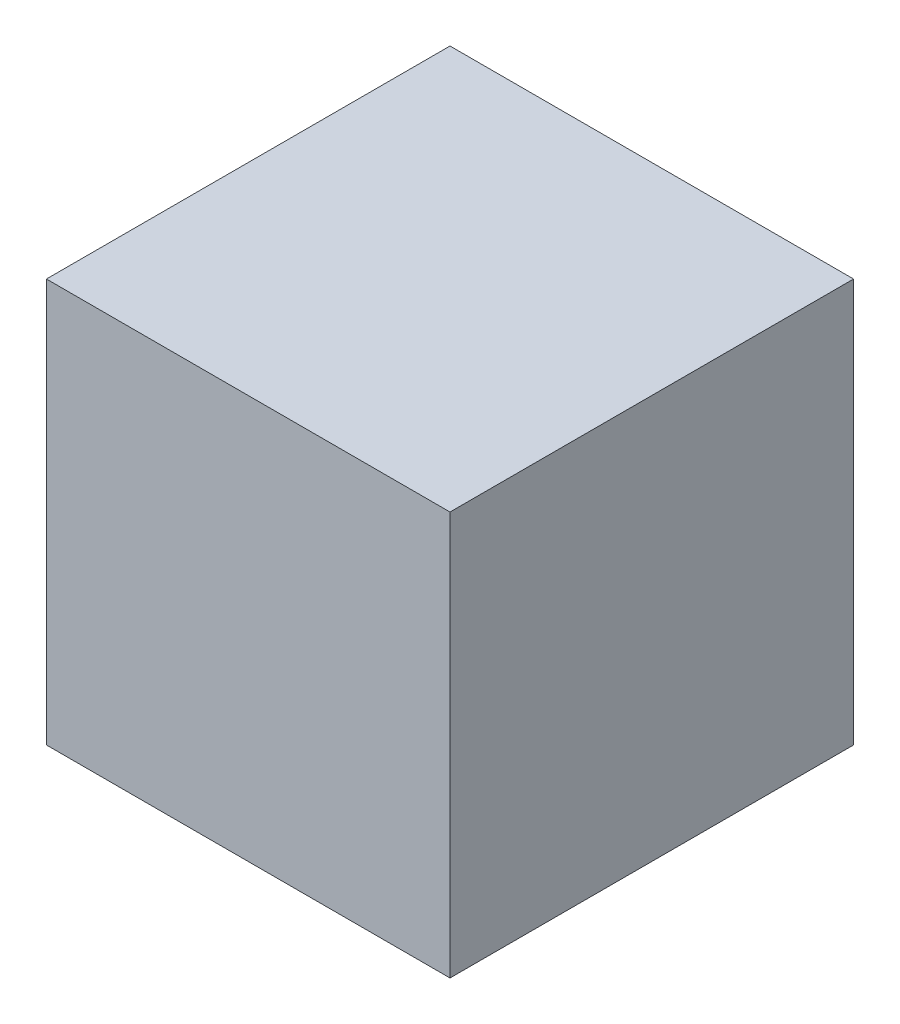
ISO-10303-21;
HEADER;
FILE_DESCRIPTION(('STEP AP214'),'2;1');
FILE_NAME('part.step','',(''),(''),'','','');
FILE_SCHEMA(('AUTOMOTIVE_DESIGN { 1 0 10303 214 1 1 1 1 }'));
ENDSEC;
DATA;
#1=APPLICATION_CONTEXT('core data for automotive mechanical design processes');
#2=APPLICATION_PROTOCOL_DEFINITION('international standard','automotive_design',2000,#1);
#3=PRODUCT_CONTEXT('',#1,'mechanical');
#4=PRODUCT('Part','Part','',(#3));
#5=PRODUCT_RELATED_PRODUCT_CATEGORY('part','',(#4));
#6=PRODUCT_DEFINITION_FORMATION('','',#4);
#7=PRODUCT_DEFINITION_CONTEXT('part definition',#1,'design');
#8=PRODUCT_DEFINITION('design','',#6,#7);
#9=PRODUCT_DEFINITION_SHAPE('','',#8);
#10=(LENGTH_UNIT() NAMED_UNIT(*) SI_UNIT(.MILLI.,.METRE.));
#11=(NAMED_UNIT(*) PLANE_ANGLE_UNIT() SI_UNIT($,.RADIAN.));
#12=(NAMED_UNIT(*) SI_UNIT($,.STERADIAN.) SOLID_ANGLE_UNIT());
#13=UNCERTAINTY_MEASURE_WITH_UNIT(LENGTH_MEASURE(1.E-05),#10,'distance_accuracy_value','');
#14=(GEOMETRIC_REPRESENTATION_CONTEXT(3) GLOBAL_UNCERTAINTY_ASSIGNED_CONTEXT((#13)) GLOBAL_UNIT_ASSIGNED_CONTEXT((#10,
#11,#12)) REPRESENTATION_CONTEXT('',''));
#15=CARTESIAN_POINT('',(0.,0.,0.));
#16=DIRECTION('',(0.,0.,1.));
#17=DIRECTION('',(1.,0.,0.));
#18=AXIS2_PLACEMENT_3D('',#15,#16,#17);
#19=CARTESIAN_POINT('',(304.8,0.,-304.8));
#20=DIRECTION('',(0.,0.,-1.));
#21=DIRECTION('',(0.,1.,0.));
#22=AXIS2_PLACEMENT_3D('',#19,#20,#21);
#23=PLANE('',#22);
#24=DIRECTION('',(0.,-1.,0.));
#25=VECTOR('',#24,1.);
#26=CARTESIAN_POINT('',(-304.8,0.,-304.8));
#27=LINE('',#26,#25);
#28=CARTESIAN_POINT('',(-304.8,609.6,-304.8));
#29=VERTEX_POINT('',#28);
#30=CARTESIAN_POINT('',(-304.8,0.,-304.8));
#31=VERTEX_POINT('',#30);
#32=EDGE_CURVE('E103',#29,#31,#27,.T.);
#33=ORIENTED_EDGE('',*,*,#32,.F.);
#34=DIRECTION('',(-1.,0.,0.));
#35=VECTOR('',#34,1.);
#36=CARTESIAN_POINT('',(304.8,609.6,-304.8));
#37=LINE('',#36,#35);
#38=CARTESIAN_POINT('',(304.8,609.6,-304.8));
#39=VERTEX_POINT('',#38);
#40=EDGE_CURVE('E11',#39,#29,#37,.T.);
#41=ORIENTED_EDGE('',*,*,#40,.F.);
#42=DIRECTION('',(0.,-1.,0.));
#43=VECTOR('',#42,1.);
#44=CARTESIAN_POINT('',(304.8,0.,-304.8));
#45=LINE('',#44,#43);
#46=CARTESIAN_POINT('',(304.8,0.,-304.8));
#47=VERTEX_POINT('',#46);
#48=EDGE_CURVE('E97',#39,#47,#45,.T.);
#49=ORIENTED_EDGE('',*,*,#48,.T.);
#50=DIRECTION('',(-1.,0.,0.));
#51=VECTOR('',#50,1.);
#52=CARTESIAN_POINT('',(304.8,0.,-304.8));
#53=LINE('',#52,#51);
#54=EDGE_CURVE('E78',#47,#31,#53,.T.);
#55=ORIENTED_EDGE('',*,*,#54,.T.);
#56=EDGE_LOOP('',(#33,#41,#49,#55));
#57=FACE_BOUND('',#56,.T.);
#58=ADVANCED_FACE('F40',(#57),#23,.T.);
#59=CARTESIAN_POINT('',(304.8,609.6,0.));
#60=DIRECTION('',(0.,1.,0.));
#61=DIRECTION('',(0.,0.,1.));
#62=AXIS2_PLACEMENT_3D('',#59,#60,#61);
#63=PLANE('',#62);
#64=DIRECTION('',(0.,0.,-1.));
#65=VECTOR('',#64,1.);
#66=CARTESIAN_POINT('',(-304.8,609.6,0.));
#67=LINE('',#66,#65);
#68=CARTESIAN_POINT('',(-304.8,609.6,304.8));
#69=VERTEX_POINT('',#68);
#70=EDGE_CURVE('E91',#69,#29,#67,.T.);
#71=ORIENTED_EDGE('',*,*,#70,.F.);
#72=DIRECTION('',(-1.,0.,0.));
#73=VECTOR('',#72,1.);
#74=CARTESIAN_POINT('',(304.8,609.6,304.8));
#75=LINE('',#74,#73);
#76=CARTESIAN_POINT('',(304.8,609.6,304.8));
#77=VERTEX_POINT('',#76);
#78=EDGE_CURVE('E48',#77,#69,#75,.T.);
#79=ORIENTED_EDGE('',*,*,#78,.F.);
#80=DIRECTION('',(0.,0.,-1.));
#81=VECTOR('',#80,1.);
#82=CARTESIAN_POINT('',(304.8,609.6,0.));
#83=LINE('',#82,#81);
#84=EDGE_CURVE('E89',#77,#39,#83,.T.);
#85=ORIENTED_EDGE('',*,*,#84,.T.);
#86=ORIENTED_EDGE('',*,*,#40,.T.);
#87=EDGE_LOOP('',(#71,#79,#85,#86));
#88=FACE_BOUND('',#87,.T.);
#89=ADVANCED_FACE('F87',(#88),#63,.T.);
#90=CARTESIAN_POINT('',(304.8,0.,304.8));
#91=DIRECTION('',(0.,0.,-1.));
#92=DIRECTION('',(0.,1.,0.));
#93=AXIS2_PLACEMENT_3D('',#90,#91,#92);
#94=PLANE('',#93);
#95=DIRECTION('',(0.,-1.,0.));
#96=VECTOR('',#95,1.);
#97=CARTESIAN_POINT('',(-304.8,0.,304.8));
#98=LINE('',#97,#96);
#99=CARTESIAN_POINT('',(-304.8,0.,304.8));
#100=VERTEX_POINT('',#99);
#101=EDGE_CURVE('E71',#69,#100,#98,.T.);
#102=ORIENTED_EDGE('',*,*,#101,.T.);
#103=DIRECTION('',(-1.,0.,0.));
#104=VECTOR('',#103,1.);
#105=CARTESIAN_POINT('',(304.8,0.,304.8));
#106=LINE('',#105,#104);
#107=CARTESIAN_POINT('',(304.8,0.,304.8));
#108=VERTEX_POINT('',#107);
#109=EDGE_CURVE('E92',#108,#100,#106,.T.);
#110=ORIENTED_EDGE('',*,*,#109,.F.);
#111=DIRECTION('',(0.,-1.,0.));
#112=VECTOR('',#111,1.);
#113=CARTESIAN_POINT('',(304.8,0.,304.8));
#114=LINE('',#113,#112);
#115=EDGE_CURVE('E93',#77,#108,#114,.T.);
#116=ORIENTED_EDGE('',*,*,#115,.F.);
#117=ORIENTED_EDGE('',*,*,#78,.T.);
#118=EDGE_LOOP('',(#102,#110,#116,#117));
#119=FACE_BOUND('',#118,.T.);
#120=ADVANCED_FACE('F94',(#119),#94,.F.);
#121=CARTESIAN_POINT('',(304.8,0.,0.));
#122=DIRECTION('',(0.,1.,0.));
#123=DIRECTION('',(0.,0.,1.));
#124=AXIS2_PLACEMENT_3D('',#121,#122,#123);
#125=PLANE('',#124);
#126=DIRECTION('',(0.,0.,-1.));
#127=VECTOR('',#126,1.);
#128=CARTESIAN_POINT('',(-304.8,0.,0.));
#129=LINE('',#128,#127);
#130=EDGE_CURVE('E99',#100,#31,#129,.T.);
#131=ORIENTED_EDGE('',*,*,#130,.T.);
#132=ORIENTED_EDGE('',*,*,#54,.F.);
#133=DIRECTION('',(0.,0.,-1.));
#134=VECTOR('',#133,1.);
#135=CARTESIAN_POINT('',(304.8,0.,0.));
#136=LINE('',#135,#134);
#137=EDGE_CURVE('E56',#108,#47,#136,.T.);
#138=ORIENTED_EDGE('',*,*,#137,.F.);
#139=ORIENTED_EDGE('',*,*,#109,.T.);
#140=EDGE_LOOP('',(#131,#132,#138,#139));
#141=FACE_BOUND('',#140,.T.);
#142=ADVANCED_FACE('F112',(#141),#125,.F.);
#143=CARTESIAN_POINT('',(304.8,0.,0.));
#144=DIRECTION('',(1.,0.,0.));
#145=DIRECTION('',(0.,0.,-1.));
#146=AXIS2_PLACEMENT_3D('',#143,#144,#145);
#147=PLANE('',#146);
#148=ORIENTED_EDGE('',*,*,#48,.F.);
#149=ORIENTED_EDGE('',*,*,#84,.F.);
#150=ORIENTED_EDGE('',*,*,#115,.T.);
#151=ORIENTED_EDGE('',*,*,#137,.T.);
#152=EDGE_LOOP('',(#148,#149,#150,#151));
#153=FACE_BOUND('',#152,.T.);
#154=ADVANCED_FACE('F96',(#153),#147,.T.);
#155=CARTESIAN_POINT('',(-304.8,0.,0.));
#156=DIRECTION('',(1.,0.,0.));
#157=DIRECTION('',(0.,0.,-1.));
#158=AXIS2_PLACEMENT_3D('',#155,#156,#157);
#159=PLANE('',#158);
#160=ORIENTED_EDGE('',*,*,#32,.T.);
#161=ORIENTED_EDGE('',*,*,#130,.F.);
#162=ORIENTED_EDGE('',*,*,#101,.F.);
#163=ORIENTED_EDGE('',*,*,#70,.T.);
#164=EDGE_LOOP('',(#160,#161,#162,#163));
#165=FACE_BOUND('',#164,.T.);
#166=ADVANCED_FACE('F114',(#165),#159,.F.);
#167=CLOSED_SHELL('',(#58,#89,#120,#142,#154,#166));
#168=MANIFOLD_SOLID_BREP('B2',#167);
#169=ADVANCED_BREP_SHAPE_REPRESENTATION('',(#18,#168),#14);
#170=SHAPE_DEFINITION_REPRESENTATION(#9,#169);
ENDSEC;
END-ISO-10303-21;
